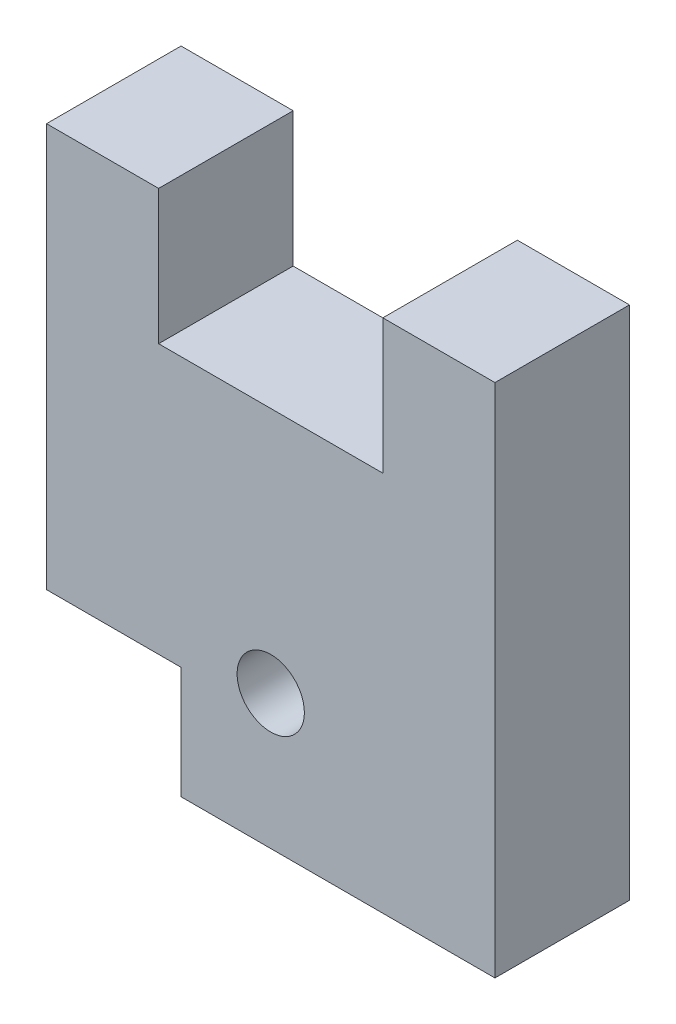
ISO-10303-21;
HEADER;
FILE_DESCRIPTION(('STEP AP214'),'2;1');
FILE_NAME('part.step','',(''),(''),'','','');
FILE_SCHEMA(('AUTOMOTIVE_DESIGN { 1 0 10303 214 1 1 1 1 }'));
ENDSEC;
DATA;
#1=APPLICATION_CONTEXT('core data for automotive mechanical design processes');
#2=APPLICATION_PROTOCOL_DEFINITION('international standard','automotive_design',2000,#1);
#3=PRODUCT_CONTEXT('',#1,'mechanical');
#4=PRODUCT('Part','Part','',(#3));
#5=PRODUCT_RELATED_PRODUCT_CATEGORY('part','',(#4));
#6=PRODUCT_DEFINITION_FORMATION('','',#4);
#7=PRODUCT_DEFINITION_CONTEXT('part definition',#1,'design');
#8=PRODUCT_DEFINITION('design','',#6,#7);
#9=PRODUCT_DEFINITION_SHAPE('','',#8);
#10=(LENGTH_UNIT() NAMED_UNIT(*) SI_UNIT(.MILLI.,.METRE.));
#11=(NAMED_UNIT(*) PLANE_ANGLE_UNIT() SI_UNIT($,.RADIAN.));
#12=(NAMED_UNIT(*) SI_UNIT($,.STERADIAN.) SOLID_ANGLE_UNIT());
#13=UNCERTAINTY_MEASURE_WITH_UNIT(LENGTH_MEASURE(1.E-05),#10,'distance_accuracy_value','');
#14=(GEOMETRIC_REPRESENTATION_CONTEXT(3) GLOBAL_UNCERTAINTY_ASSIGNED_CONTEXT((#13)) GLOBAL_UNIT_ASSIGNED_CONTEXT((#10,
#11,#12)) REPRESENTATION_CONTEXT('',''));
#15=CARTESIAN_POINT('',(0.,0.,0.));
#16=DIRECTION('',(0.,0.,1.));
#17=DIRECTION('',(1.,0.,0.));
#18=AXIS2_PLACEMENT_3D('',#15,#16,#17);
#19=CARTESIAN_POINT('',(0.,0.,6.));
#20=DIRECTION('',(0.,0.,1.));
#21=DIRECTION('',(1.,0.,0.));
#22=AXIS2_PLACEMENT_3D('',#19,#20,#21);
#23=PLANE('',#22);
#24=DIRECTION('',(0.,-1.,0.));
#25=VECTOR('',#24,1.);
#26=CARTESIAN_POINT('',(0.,0.,6.));
#27=LINE('',#26,#25);
#28=CARTESIAN_POINT('',(0.,0.,6.));
#29=VERTEX_POINT('',#28);
#30=CARTESIAN_POINT('',(0.,-18.,6.));
#31=VERTEX_POINT('',#30);
#32=EDGE_CURVE('E162',#29,#31,#27,.T.);
#33=ORIENTED_EDGE('',*,*,#32,.T.);
#34=DIRECTION('',(1.,0.,0.));
#35=VECTOR('',#34,1.);
#36=CARTESIAN_POINT('',(0.,-18.,6.));
#37=LINE('',#36,#35);
#38=CARTESIAN_POINT('',(6.,-18.,6.));
#39=VERTEX_POINT('',#38);
#40=EDGE_CURVE('E100',#31,#39,#37,.T.);
#41=ORIENTED_EDGE('',*,*,#40,.T.);
#42=DIRECTION('',(0.,-1.,0.));
#43=VECTOR('',#42,1.);
#44=CARTESIAN_POINT('',(6.,-23.,6.));
#45=LINE('',#44,#43);
#46=CARTESIAN_POINT('',(6.,-23.,6.));
#47=VERTEX_POINT('',#46);
#48=EDGE_CURVE('E183',#39,#47,#45,.T.);
#49=ORIENTED_EDGE('',*,*,#48,.T.);
#50=DIRECTION('',(1.,0.,0.));
#51=VECTOR('',#50,1.);
#52=CARTESIAN_POINT('',(6.,-23.,6.));
#53=LINE('',#52,#51);
#54=CARTESIAN_POINT('',(20.,-23.,6.));
#55=VERTEX_POINT('',#54);
#56=EDGE_CURVE('E202',#47,#55,#53,.T.);
#57=ORIENTED_EDGE('',*,*,#56,.T.);
#58=DIRECTION('',(0.,1.,0.));
#59=VECTOR('',#58,1.);
#60=CARTESIAN_POINT('',(20.,0.,6.));
#61=LINE('',#60,#59);
#62=CARTESIAN_POINT('',(20.,0.,6.));
#63=VERTEX_POINT('',#62);
#64=EDGE_CURVE('E199',#55,#63,#61,.T.);
#65=ORIENTED_EDGE('',*,*,#64,.T.);
#66=DIRECTION('',(-1.,0.,0.));
#67=VECTOR('',#66,1.);
#68=CARTESIAN_POINT('',(15.,0.,6.));
#69=LINE('',#68,#67);
#70=CARTESIAN_POINT('',(15.,0.,6.));
#71=VERTEX_POINT('',#70);
#72=EDGE_CURVE('E201',#63,#71,#69,.T.);
#73=ORIENTED_EDGE('',*,*,#72,.T.);
#74=DIRECTION('',(0.,-1.,0.));
#75=VECTOR('',#74,1.);
#76=CARTESIAN_POINT('',(15.,0.,6.));
#77=LINE('',#76,#75);
#78=CARTESIAN_POINT('',(15.,-6.,6.));
#79=VERTEX_POINT('',#78);
#80=EDGE_CURVE('E125',#71,#79,#77,.T.);
#81=ORIENTED_EDGE('',*,*,#80,.T.);
#82=DIRECTION('',(-1.,0.,0.));
#83=VECTOR('',#82,1.);
#84=CARTESIAN_POINT('',(5.,-6.,6.));
#85=LINE('',#84,#83);
#86=CARTESIAN_POINT('',(5.,-6.,6.));
#87=VERTEX_POINT('',#86);
#88=EDGE_CURVE('E119',#79,#87,#85,.T.);
#89=ORIENTED_EDGE('',*,*,#88,.T.);
#90=DIRECTION('',(0.,1.,0.));
#91=VECTOR('',#90,1.);
#92=CARTESIAN_POINT('',(5.,0.,6.));
#93=LINE('',#92,#91);
#94=CARTESIAN_POINT('',(5.,0.,6.));
#95=VERTEX_POINT('',#94);
#96=EDGE_CURVE('E123',#87,#95,#93,.T.);
#97=ORIENTED_EDGE('',*,*,#96,.T.);
#98=DIRECTION('',(-1.,0.,0.));
#99=VECTOR('',#98,1.);
#100=CARTESIAN_POINT('',(0.,0.,6.));
#101=LINE('',#100,#99);
#102=EDGE_CURVE('E51',#95,#29,#101,.T.);
#103=ORIENTED_EDGE('',*,*,#102,.T.);
#104=EDGE_LOOP('',(#33,#41,#49,#57,#65,#73,#81,#89,#97,#103));
#105=FACE_BOUND('',#104,.T.);
#106=CARTESIAN_POINT('',(10.,-17.,6.));
#107=DIRECTION('',(0.,0.,1.));
#108=DIRECTION('',(1.,0.,0.));
#109=AXIS2_PLACEMENT_3D('',#106,#107,#108);
#110=CIRCLE('',#109,1.5);
#111=CARTESIAN_POINT('',(11.5,-17.,6.));
#112=VERTEX_POINT('',#111);
#113=EDGE_CURVE('E147',#112,#112,#110,.T.);
#114=ORIENTED_EDGE('',*,*,#113,.F.);
#115=EDGE_LOOP('',(#114));
#116=FACE_BOUND('',#115,.T.);
#117=ADVANCED_FACE('F34',(#105,#116),#23,.T.);
#118=CARTESIAN_POINT('',(0.,0.,0.));
#119=DIRECTION('',(0.,0.,1.));
#120=DIRECTION('',(1.,0.,0.));
#121=AXIS2_PLACEMENT_3D('',#118,#119,#120);
#122=PLANE('',#121);
#123=DIRECTION('',(0.,-1.,0.));
#124=VECTOR('',#123,1.);
#125=CARTESIAN_POINT('',(0.,0.,0.));
#126=LINE('',#125,#124);
#127=CARTESIAN_POINT('',(0.,0.,0.));
#128=VERTEX_POINT('',#127);
#129=CARTESIAN_POINT('',(0.,-18.,0.));
#130=VERTEX_POINT('',#129);
#131=EDGE_CURVE('E143',#128,#130,#126,.T.);
#132=ORIENTED_EDGE('',*,*,#131,.F.);
#133=DIRECTION('',(-1.,0.,0.));
#134=VECTOR('',#133,1.);
#135=CARTESIAN_POINT('',(0.,0.,0.));
#136=LINE('',#135,#134);
#137=CARTESIAN_POINT('',(5.,0.,0.));
#138=VERTEX_POINT('',#137);
#139=EDGE_CURVE('E92',#138,#128,#136,.T.);
#140=ORIENTED_EDGE('',*,*,#139,.F.);
#141=DIRECTION('',(0.,1.,0.));
#142=VECTOR('',#141,1.);
#143=CARTESIAN_POINT('',(5.,0.,0.));
#144=LINE('',#143,#142);
#145=CARTESIAN_POINT('',(5.,-6.,0.));
#146=VERTEX_POINT('',#145);
#147=EDGE_CURVE('E86',#146,#138,#144,.T.);
#148=ORIENTED_EDGE('',*,*,#147,.F.);
#149=DIRECTION('',(-1.,0.,0.));
#150=VECTOR('',#149,1.);
#151=CARTESIAN_POINT('',(5.,-6.,0.));
#152=LINE('',#151,#150);
#153=CARTESIAN_POINT('',(15.,-6.,0.));
#154=VERTEX_POINT('',#153);
#155=EDGE_CURVE('E133',#154,#146,#152,.T.);
#156=ORIENTED_EDGE('',*,*,#155,.F.);
#157=DIRECTION('',(0.,-1.,0.));
#158=VECTOR('',#157,1.);
#159=CARTESIAN_POINT('',(15.,0.,0.));
#160=LINE('',#159,#158);
#161=CARTESIAN_POINT('',(15.,0.,0.));
#162=VERTEX_POINT('',#161);
#163=EDGE_CURVE('E157',#162,#154,#160,.T.);
#164=ORIENTED_EDGE('',*,*,#163,.F.);
#165=DIRECTION('',(-1.,0.,0.));
#166=VECTOR('',#165,1.);
#167=CARTESIAN_POINT('',(15.,0.,0.));
#168=LINE('',#167,#166);
#169=CARTESIAN_POINT('',(20.,0.,0.));
#170=VERTEX_POINT('',#169);
#171=EDGE_CURVE('E155',#170,#162,#168,.T.);
#172=ORIENTED_EDGE('',*,*,#171,.F.);
#173=DIRECTION('',(0.,1.,0.));
#174=VECTOR('',#173,1.);
#175=CARTESIAN_POINT('',(20.,0.,0.));
#176=LINE('',#175,#174);
#177=CARTESIAN_POINT('',(20.,-23.,0.));
#178=VERTEX_POINT('',#177);
#179=EDGE_CURVE('E153',#178,#170,#176,.T.);
#180=ORIENTED_EDGE('',*,*,#179,.F.);
#181=DIRECTION('',(1.,0.,0.));
#182=VECTOR('',#181,1.);
#183=CARTESIAN_POINT('',(6.,-23.,0.));
#184=LINE('',#183,#182);
#185=CARTESIAN_POINT('',(6.,-23.,0.));
#186=VERTEX_POINT('',#185);
#187=EDGE_CURVE('E151',#186,#178,#184,.T.);
#188=ORIENTED_EDGE('',*,*,#187,.F.);
#189=DIRECTION('',(0.,-1.,0.));
#190=VECTOR('',#189,1.);
#191=CARTESIAN_POINT('',(6.,-23.,0.));
#192=LINE('',#191,#190);
#193=CARTESIAN_POINT('',(6.,-18.,0.));
#194=VERTEX_POINT('',#193);
#195=EDGE_CURVE('E149',#194,#186,#192,.T.);
#196=ORIENTED_EDGE('',*,*,#195,.F.);
#197=DIRECTION('',(1.,0.,0.));
#198=VECTOR('',#197,1.);
#199=CARTESIAN_POINT('',(0.,-18.,0.));
#200=LINE('',#199,#198);
#201=EDGE_CURVE('E146',#130,#194,#200,.T.);
#202=ORIENTED_EDGE('',*,*,#201,.F.);
#203=EDGE_LOOP('',(#132,#140,#148,#156,#164,#172,#180,#188,#196,#202));
#204=FACE_BOUND('',#203,.T.);
#205=CARTESIAN_POINT('',(10.,-17.,0.));
#206=DIRECTION('',(0.,0.,1.));
#207=DIRECTION('',(1.,0.,0.));
#208=AXIS2_PLACEMENT_3D('',#205,#206,#207);
#209=CIRCLE('',#208,1.5);
#210=CARTESIAN_POINT('',(11.5,-17.,0.));
#211=VERTEX_POINT('',#210);
#212=EDGE_CURVE('E210',#211,#211,#209,.T.);
#213=ORIENTED_EDGE('',*,*,#212,.T.);
#214=EDGE_LOOP('',(#213));
#215=FACE_BOUND('',#214,.T.);
#216=ADVANCED_FACE('F187',(#204,#215),#122,.F.);
#217=CARTESIAN_POINT('',(0.,0.,6.));
#218=DIRECTION('',(1.,0.,0.));
#219=DIRECTION('',(0.,1.,0.));
#220=AXIS2_PLACEMENT_3D('',#217,#218,#219);
#221=PLANE('',#220);
#222=ORIENTED_EDGE('',*,*,#131,.T.);
#223=DIRECTION('',(0.,0.,-1.));
#224=VECTOR('',#223,1.);
#225=CARTESIAN_POINT('',(0.,-18.,6.));
#226=LINE('',#225,#224);
#227=EDGE_CURVE('E11',#31,#130,#226,.T.);
#228=ORIENTED_EDGE('',*,*,#227,.F.);
#229=ORIENTED_EDGE('',*,*,#32,.F.);
#230=DIRECTION('',(0.,0.,-1.));
#231=VECTOR('',#230,1.);
#232=CARTESIAN_POINT('',(0.,0.,6.));
#233=LINE('',#232,#231);
#234=EDGE_CURVE('E139',#29,#128,#233,.T.);
#235=ORIENTED_EDGE('',*,*,#234,.T.);
#236=EDGE_LOOP('',(#222,#228,#229,#235));
#237=FACE_BOUND('',#236,.T.);
#238=ADVANCED_FACE('F36',(#237),#221,.F.);
#239=CARTESIAN_POINT('',(0.,-18.,6.));
#240=DIRECTION('',(0.,1.,0.));
#241=DIRECTION('',(-1.,0.,0.));
#242=AXIS2_PLACEMENT_3D('',#239,#240,#241);
#243=PLANE('',#242);
#244=ORIENTED_EDGE('',*,*,#201,.T.);
#245=DIRECTION('',(0.,0.,-1.));
#246=VECTOR('',#245,1.);
#247=CARTESIAN_POINT('',(6.,-18.,6.));
#248=LINE('',#247,#246);
#249=EDGE_CURVE('E43',#39,#194,#248,.T.);
#250=ORIENTED_EDGE('',*,*,#249,.F.);
#251=ORIENTED_EDGE('',*,*,#40,.F.);
#252=ORIENTED_EDGE('',*,*,#227,.T.);
#253=EDGE_LOOP('',(#244,#250,#251,#252));
#254=FACE_BOUND('',#253,.T.);
#255=ADVANCED_FACE('F246',(#254),#243,.F.);
#256=CARTESIAN_POINT('',(6.,-23.,6.));
#257=DIRECTION('',(1.,0.,0.));
#258=DIRECTION('',(0.,0.,-1.));
#259=AXIS2_PLACEMENT_3D('',#256,#257,#258);
#260=PLANE('',#259);
#261=ORIENTED_EDGE('',*,*,#195,.T.);
#262=DIRECTION('',(0.,0.,-1.));
#263=VECTOR('',#262,1.);
#264=CARTESIAN_POINT('',(6.,-23.,6.));
#265=LINE('',#264,#263);
#266=EDGE_CURVE('E175',#47,#186,#265,.T.);
#267=ORIENTED_EDGE('',*,*,#266,.F.);
#268=ORIENTED_EDGE('',*,*,#48,.F.);
#269=ORIENTED_EDGE('',*,*,#249,.T.);
#270=EDGE_LOOP('',(#261,#267,#268,#269));
#271=FACE_BOUND('',#270,.T.);
#272=ADVANCED_FACE('F181',(#271),#260,.F.);
#273=CARTESIAN_POINT('',(6.,-23.,6.));
#274=DIRECTION('',(0.,1.,0.));
#275=DIRECTION('',(0.,0.,1.));
#276=AXIS2_PLACEMENT_3D('',#273,#274,#275);
#277=PLANE('',#276);
#278=ORIENTED_EDGE('',*,*,#187,.T.);
#279=DIRECTION('',(0.,0.,-1.));
#280=VECTOR('',#279,1.);
#281=CARTESIAN_POINT('',(20.,-23.,6.));
#282=LINE('',#281,#280);
#283=EDGE_CURVE('E172',#55,#178,#282,.T.);
#284=ORIENTED_EDGE('',*,*,#283,.F.);
#285=ORIENTED_EDGE('',*,*,#56,.F.);
#286=ORIENTED_EDGE('',*,*,#266,.T.);
#287=EDGE_LOOP('',(#278,#284,#285,#286));
#288=FACE_BOUND('',#287,.T.);
#289=ADVANCED_FACE('F193',(#288),#277,.F.);
#290=CARTESIAN_POINT('',(20.,0.,6.));
#291=DIRECTION('',(-1.,0.,0.));
#292=DIRECTION('',(0.,-1.,0.));
#293=AXIS2_PLACEMENT_3D('',#290,#291,#292);
#294=PLANE('',#293);
#295=ORIENTED_EDGE('',*,*,#179,.T.);
#296=DIRECTION('',(0.,0.,-1.));
#297=VECTOR('',#296,1.);
#298=CARTESIAN_POINT('',(20.,0.,6.));
#299=LINE('',#298,#297);
#300=EDGE_CURVE('E169',#63,#170,#299,.T.);
#301=ORIENTED_EDGE('',*,*,#300,.F.);
#302=ORIENTED_EDGE('',*,*,#64,.F.);
#303=ORIENTED_EDGE('',*,*,#283,.T.);
#304=EDGE_LOOP('',(#295,#301,#302,#303));
#305=FACE_BOUND('',#304,.T.);
#306=ADVANCED_FACE('F197',(#305),#294,.F.);
#307=CARTESIAN_POINT('',(15.,0.,6.));
#308=DIRECTION('',(0.,-1.,0.));
#309=DIRECTION('',(0.,0.,-1.));
#310=AXIS2_PLACEMENT_3D('',#307,#308,#309);
#311=PLANE('',#310);
#312=ORIENTED_EDGE('',*,*,#171,.T.);
#313=DIRECTION('',(0.,0.,-1.));
#314=VECTOR('',#313,1.);
#315=CARTESIAN_POINT('',(15.,0.,6.));
#316=LINE('',#315,#314);
#317=EDGE_CURVE('E166',#71,#162,#316,.T.);
#318=ORIENTED_EDGE('',*,*,#317,.F.);
#319=ORIENTED_EDGE('',*,*,#72,.F.);
#320=ORIENTED_EDGE('',*,*,#300,.T.);
#321=EDGE_LOOP('',(#312,#318,#319,#320));
#322=FACE_BOUND('',#321,.T.);
#323=ADVANCED_FACE('F236',(#322),#311,.F.);
#324=CARTESIAN_POINT('',(15.,0.,6.));
#325=DIRECTION('',(1.,0.,0.));
#326=DIRECTION('',(0.,1.,0.));
#327=AXIS2_PLACEMENT_3D('',#324,#325,#326);
#328=PLANE('',#327);
#329=ORIENTED_EDGE('',*,*,#163,.T.);
#330=DIRECTION('',(0.,0.,-1.));
#331=VECTOR('',#330,1.);
#332=CARTESIAN_POINT('',(15.,-6.,6.));
#333=LINE('',#332,#331);
#334=EDGE_CURVE('E134',#79,#154,#333,.T.);
#335=ORIENTED_EDGE('',*,*,#334,.F.);
#336=ORIENTED_EDGE('',*,*,#80,.F.);
#337=ORIENTED_EDGE('',*,*,#317,.T.);
#338=EDGE_LOOP('',(#329,#335,#336,#337));
#339=FACE_BOUND('',#338,.T.);
#340=ADVANCED_FACE('F233',(#339),#328,.F.);
#341=CARTESIAN_POINT('',(5.,-6.,6.));
#342=DIRECTION('',(0.,-1.,0.));
#343=DIRECTION('',(0.,0.,-1.));
#344=AXIS2_PLACEMENT_3D('',#341,#342,#343);
#345=PLANE('',#344);
#346=ORIENTED_EDGE('',*,*,#155,.T.);
#347=DIRECTION('',(0.,0.,-1.));
#348=VECTOR('',#347,1.);
#349=CARTESIAN_POINT('',(5.,-6.,6.));
#350=LINE('',#349,#348);
#351=EDGE_CURVE('E130',#87,#146,#350,.T.);
#352=ORIENTED_EDGE('',*,*,#351,.F.);
#353=ORIENTED_EDGE('',*,*,#88,.F.);
#354=ORIENTED_EDGE('',*,*,#334,.T.);
#355=EDGE_LOOP('',(#346,#352,#353,#354));
#356=FACE_BOUND('',#355,.T.);
#357=ADVANCED_FACE('F131',(#356),#345,.F.);
#358=CARTESIAN_POINT('',(5.,0.,6.));
#359=DIRECTION('',(-1.,0.,0.));
#360=DIRECTION('',(0.,-1.,0.));
#361=AXIS2_PLACEMENT_3D('',#358,#359,#360);
#362=PLANE('',#361);
#363=ORIENTED_EDGE('',*,*,#147,.T.);
#364=DIRECTION('',(0.,0.,-1.));
#365=VECTOR('',#364,1.);
#366=CARTESIAN_POINT('',(5.,0.,6.));
#367=LINE('',#366,#365);
#368=EDGE_CURVE('E135',#95,#138,#367,.T.);
#369=ORIENTED_EDGE('',*,*,#368,.F.);
#370=ORIENTED_EDGE('',*,*,#96,.F.);
#371=ORIENTED_EDGE('',*,*,#351,.T.);
#372=EDGE_LOOP('',(#363,#369,#370,#371));
#373=FACE_BOUND('',#372,.T.);
#374=ADVANCED_FACE('F137',(#373),#362,.F.);
#375=CARTESIAN_POINT('',(0.,0.,6.));
#376=DIRECTION('',(0.,-1.,0.));
#377=DIRECTION('',(0.,0.,-1.));
#378=AXIS2_PLACEMENT_3D('',#375,#376,#377);
#379=PLANE('',#378);
#380=ORIENTED_EDGE('',*,*,#139,.T.);
#381=ORIENTED_EDGE('',*,*,#234,.F.);
#382=ORIENTED_EDGE('',*,*,#102,.F.);
#383=ORIENTED_EDGE('',*,*,#368,.T.);
#384=EDGE_LOOP('',(#380,#381,#382,#383));
#385=FACE_BOUND('',#384,.T.);
#386=ADVANCED_FACE('F226',(#385),#379,.F.);
#387=CARTESIAN_POINT('',(10.,-17.,6.));
#388=DIRECTION('',(0.,0.,-1.));
#389=DIRECTION('',(-1.,0.,0.));
#390=AXIS2_PLACEMENT_3D('',#387,#388,#389);
#391=CYLINDRICAL_SURFACE('',#390,1.5);
#392=ORIENTED_EDGE('',*,*,#113,.T.);
#393=EDGE_LOOP('',(#392));
#394=FACE_BOUND('',#393,.T.);
#395=ORIENTED_EDGE('',*,*,#212,.F.);
#396=EDGE_LOOP('',(#395));
#397=FACE_BOUND('',#396,.T.);
#398=ADVANCED_FACE('F216',(#394,#397),#391,.F.);
#399=CLOSED_SHELL('',(#117,#216,#238,#255,#272,#289,#306,#323,#340,#357,#374,#386,#398));
#400=MANIFOLD_SOLID_BREP('B2',#399);
#401=ADVANCED_BREP_SHAPE_REPRESENTATION('',(#18,#400),#14);
#402=SHAPE_DEFINITION_REPRESENTATION(#9,#401);
ENDSEC;
END-ISO-10303-21;
